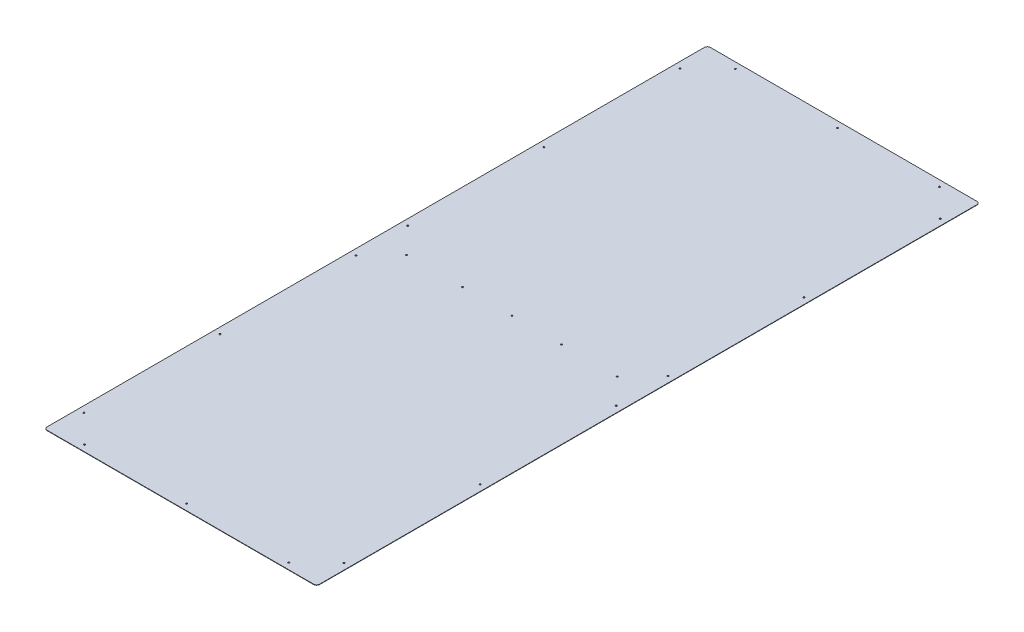
ISO-10303-21;
HEADER;
FILE_DESCRIPTION(('STEP AP214'),'2;1');
FILE_NAME('part.step','',(''),(''),'','','');
FILE_SCHEMA(('AUTOMOTIVE_DESIGN { 1 0 10303 214 1 1 1 1 }'));
ENDSEC;
DATA;
#1=APPLICATION_CONTEXT('core data for automotive mechanical design processes');
#2=APPLICATION_PROTOCOL_DEFINITION('international standard','automotive_design',2000,#1);
#3=PRODUCT_CONTEXT('',#1,'mechanical');
#4=PRODUCT('Part','Part','',(#3));
#5=PRODUCT_RELATED_PRODUCT_CATEGORY('part','',(#4));
#6=PRODUCT_DEFINITION_FORMATION('','',#4);
#7=PRODUCT_DEFINITION_CONTEXT('part definition',#1,'design');
#8=PRODUCT_DEFINITION('design','',#6,#7);
#9=PRODUCT_DEFINITION_SHAPE('','',#8);
#10=(LENGTH_UNIT() NAMED_UNIT(*) SI_UNIT(.MILLI.,.METRE.));
#11=(NAMED_UNIT(*) PLANE_ANGLE_UNIT() SI_UNIT($,.RADIAN.));
#12=(NAMED_UNIT(*) SI_UNIT($,.STERADIAN.) SOLID_ANGLE_UNIT());
#13=UNCERTAINTY_MEASURE_WITH_UNIT(LENGTH_MEASURE(1.E-05),#10,'distance_accuracy_value','');
#14=(GEOMETRIC_REPRESENTATION_CONTEXT(3) GLOBAL_UNCERTAINTY_ASSIGNED_CONTEXT((#13)) GLOBAL_UNIT_ASSIGNED_CONTEXT((#10,
#11,#12)) REPRESENTATION_CONTEXT('',''));
#15=CARTESIAN_POINT('',(0.,0.,0.));
#16=DIRECTION('',(0.,0.,1.));
#17=DIRECTION('',(1.,0.,0.));
#18=AXIS2_PLACEMENT_3D('',#15,#16,#17);
#19=CARTESIAN_POINT('',(279.5524,0.79375,680.3644));
#20=DIRECTION('',(-1.,0.,0.));
#21=DIRECTION('',(0.,0.,1.));
#22=AXIS2_PLACEMENT_3D('',#19,#20,#21);
#23=PLANE('',#22);
#24=DIRECTION('',(0.,0.,-1.));
#25=VECTOR('',#24,1.);
#26=CARTESIAN_POINT('',(279.5524,0.,680.3644));
#27=LINE('',#26,#25);
#28=CARTESIAN_POINT('',(279.5524,0.,674.0144));
#29=VERTEX_POINT('',#28);
#30=CARTESIAN_POINT('',(279.5524,0.,-674.0144));
#31=VERTEX_POINT('',#30);
#32=EDGE_CURVE('E131',#29,#31,#27,.T.);
#33=ORIENTED_EDGE('',*,*,#32,.T.);
#34=DIRECTION('',(0.,-1.,0.));
#35=VECTOR('',#34,1.);
#36=CARTESIAN_POINT('',(279.5524,0.79375,-674.0144));
#37=LINE('',#36,#35);
#38=CARTESIAN_POINT('',(279.5524,0.79375,-674.0144));
#39=VERTEX_POINT('',#38);
#40=EDGE_CURVE('E153',#31,#39,#37,.F.);
#41=ORIENTED_EDGE('',*,*,#40,.T.);
#42=DIRECTION('',(0.,0.,-1.));
#43=VECTOR('',#42,1.);
#44=CARTESIAN_POINT('',(279.5524,0.79375,680.3644));
#45=LINE('',#44,#43);
#46=CARTESIAN_POINT('',(279.5524,0.79375,674.0144));
#47=VERTEX_POINT('',#46);
#48=EDGE_CURVE('E129',#47,#39,#45,.T.);
#49=ORIENTED_EDGE('',*,*,#48,.F.);
#50=DIRECTION('',(0.,-1.,0.));
#51=VECTOR('',#50,1.);
#52=CARTESIAN_POINT('',(279.5524,0.79375,674.0144));
#53=LINE('',#52,#51);
#54=EDGE_CURVE('E150',#47,#29,#53,.T.);
#55=ORIENTED_EDGE('',*,*,#54,.T.);
#56=EDGE_LOOP('',(#33,#41,#49,#55));
#57=FACE_BOUND('',#56,.T.);
#58=ADVANCED_FACE('F34',(#57),#23,.F.);
#59=CARTESIAN_POINT('',(-279.5524,0.79375,-680.3644));
#60=DIRECTION('',(0.,0.,1.));
#61=DIRECTION('',(1.,0.,0.));
#62=AXIS2_PLACEMENT_3D('',#59,#60,#61);
#63=PLANE('',#62);
#64=DIRECTION('',(-1.,0.,0.));
#65=VECTOR('',#64,1.);
#66=CARTESIAN_POINT('',(-279.5524,0.,-680.3644));
#67=LINE('',#66,#65);
#68=CARTESIAN_POINT('',(273.2024,0.,-680.3644));
#69=VERTEX_POINT('',#68);
#70=CARTESIAN_POINT('',(-273.2024,0.,-680.3644));
#71=VERTEX_POINT('',#70);
#72=EDGE_CURVE('E127',#69,#71,#67,.T.);
#73=ORIENTED_EDGE('',*,*,#72,.T.);
#74=DIRECTION('',(0.,-1.,0.));
#75=VECTOR('',#74,1.);
#76=CARTESIAN_POINT('',(-273.2024,0.79375,-680.3644));
#77=LINE('',#76,#75);
#78=CARTESIAN_POINT('',(-273.2024,0.79375,-680.3644));
#79=VERTEX_POINT('',#78);
#80=EDGE_CURVE('E105',#71,#79,#77,.F.);
#81=ORIENTED_EDGE('',*,*,#80,.T.);
#82=DIRECTION('',(-1.,0.,0.));
#83=VECTOR('',#82,1.);
#84=CARTESIAN_POINT('',(-279.5524,0.79375,-680.3644));
#85=LINE('',#84,#83);
#86=CARTESIAN_POINT('',(273.2024,0.79375,-680.3644));
#87=VERTEX_POINT('',#86);
#88=EDGE_CURVE('E167',#87,#79,#85,.T.);
#89=ORIENTED_EDGE('',*,*,#88,.F.);
#90=DIRECTION('',(0.,-1.,0.));
#91=VECTOR('',#90,1.);
#92=CARTESIAN_POINT('',(273.2024,0.79375,-680.3644));
#93=LINE('',#92,#91);
#94=EDGE_CURVE('E110',#87,#69,#93,.T.);
#95=ORIENTED_EDGE('',*,*,#94,.T.);
#96=EDGE_LOOP('',(#73,#81,#89,#95));
#97=FACE_BOUND('',#96,.T.);
#98=ADVANCED_FACE('F172',(#97),#63,.F.);
#99=CARTESIAN_POINT('',(-279.5524,0.79375,680.3644));
#100=DIRECTION('',(1.,0.,0.));
#101=DIRECTION('',(0.,0.,-1.));
#102=AXIS2_PLACEMENT_3D('',#99,#100,#101);
#103=PLANE('',#102);
#104=DIRECTION('',(0.,0.,1.));
#105=VECTOR('',#104,1.);
#106=CARTESIAN_POINT('',(-279.5524,0.79375,680.3644));
#107=LINE('',#106,#105);
#108=CARTESIAN_POINT('',(-279.5524,0.79375,-674.0144));
#109=VERTEX_POINT('',#108);
#110=CARTESIAN_POINT('',(-279.5524,0.79375,674.0144));
#111=VERTEX_POINT('',#110);
#112=EDGE_CURVE('E119',#109,#111,#107,.T.);
#113=ORIENTED_EDGE('',*,*,#112,.F.);
#114=DIRECTION('',(0.,-1.,0.));
#115=VECTOR('',#114,1.);
#116=CARTESIAN_POINT('',(-279.5524,0.79375,-674.0144));
#117=LINE('',#116,#115);
#118=CARTESIAN_POINT('',(-279.5524,0.,-674.0144));
#119=VERTEX_POINT('',#118);
#120=EDGE_CURVE('E104',#109,#119,#117,.T.);
#121=ORIENTED_EDGE('',*,*,#120,.T.);
#122=DIRECTION('',(0.,0.,1.));
#123=VECTOR('',#122,1.);
#124=CARTESIAN_POINT('',(-279.5524,0.,680.3644));
#125=LINE('',#124,#123);
#126=CARTESIAN_POINT('',(-279.5524,0.,674.0144));
#127=VERTEX_POINT('',#126);
#128=EDGE_CURVE('E117',#119,#127,#125,.T.);
#129=ORIENTED_EDGE('',*,*,#128,.T.);
#130=DIRECTION('',(0.,-1.,0.));
#131=VECTOR('',#130,1.);
#132=CARTESIAN_POINT('',(-279.5524,0.79375,674.0144));
#133=LINE('',#132,#131);
#134=EDGE_CURVE('E121',#127,#111,#133,.F.);
#135=ORIENTED_EDGE('',*,*,#134,.T.);
#136=EDGE_LOOP('',(#113,#121,#129,#135));
#137=FACE_BOUND('',#136,.T.);
#138=ADVANCED_FACE('F116',(#137),#103,.F.);
#139=CARTESIAN_POINT('',(-279.5524,0.79375,680.3644));
#140=DIRECTION('',(0.,0.,-1.));
#141=DIRECTION('',(-1.,0.,0.));
#142=AXIS2_PLACEMENT_3D('',#139,#140,#141);
#143=PLANE('',#142);
#144=DIRECTION('',(1.,0.,0.));
#145=VECTOR('',#144,1.);
#146=CARTESIAN_POINT('',(-279.5524,0.79375,680.3644));
#147=LINE('',#146,#145);
#148=CARTESIAN_POINT('',(-273.2024,0.79375,680.3644));
#149=VERTEX_POINT('',#148);
#150=CARTESIAN_POINT('',(273.2024,0.79375,680.3644));
#151=VERTEX_POINT('',#150);
#152=EDGE_CURVE('E135',#149,#151,#147,.T.);
#153=ORIENTED_EDGE('',*,*,#152,.F.);
#154=DIRECTION('',(0.,-1.,0.));
#155=VECTOR('',#154,1.);
#156=CARTESIAN_POINT('',(-273.2024,0.79375,680.3644));
#157=LINE('',#156,#155);
#158=CARTESIAN_POINT('',(-273.2024,0.,680.3644));
#159=VERTEX_POINT('',#158);
#160=EDGE_CURVE('E11',#149,#159,#157,.T.);
#161=ORIENTED_EDGE('',*,*,#160,.T.);
#162=DIRECTION('',(1.,0.,0.));
#163=VECTOR('',#162,1.);
#164=CARTESIAN_POINT('',(-279.5524,0.,680.3644));
#165=LINE('',#164,#163);
#166=CARTESIAN_POINT('',(273.2024,0.,680.3644));
#167=VERTEX_POINT('',#166);
#168=EDGE_CURVE('E126',#159,#167,#165,.T.);
#169=ORIENTED_EDGE('',*,*,#168,.T.);
#170=DIRECTION('',(0.,-1.,0.));
#171=VECTOR('',#170,1.);
#172=CARTESIAN_POINT('',(273.2024,0.79375,680.3644));
#173=LINE('',#172,#171);
#174=EDGE_CURVE('E42',#167,#151,#173,.F.);
#175=ORIENTED_EDGE('',*,*,#174,.T.);
#176=EDGE_LOOP('',(#153,#161,#169,#175));
#177=FACE_BOUND('',#176,.T.);
#178=ADVANCED_FACE('F397',(#177),#143,.F.);
#179=CARTESIAN_POINT('',(0.,0.79375,0.));
#180=DIRECTION('',(0.,-1.,0.));
#181=DIRECTION('',(0.,0.,-1.));
#182=AXIS2_PLACEMENT_3D('',#179,#180,#181);
#183=PLANE('',#182);
#184=CARTESIAN_POINT('',(266.8524,0.79375,611.632));
#185=DIRECTION('',(0.,-1.,0.));
#186=DIRECTION('',(0.,0.,-1.));
#187=AXIS2_PLACEMENT_3D('',#184,#185,#186);
#188=CIRCLE('',#187,1.58750000000002);
#189=CARTESIAN_POINT('',(266.8524,0.79375,610.0445));
#190=VERTEX_POINT('',#189);
#191=EDGE_CURVE('E309',#190,#190,#188,.T.);
#192=ORIENTED_EDGE('',*,*,#191,.T.);
#193=EDGE_LOOP('',(#192));
#194=FACE_BOUND('',#193,.T.);
#195=CARTESIAN_POINT('',(209.55,0.79375,667.6644));
#196=DIRECTION('',(0.,-1.,0.));
#197=DIRECTION('',(0.,0.,-1.));
#198=AXIS2_PLACEMENT_3D('',#195,#196,#197);
#199=CIRCLE('',#198,1.58749999999999);
#200=CARTESIAN_POINT('',(209.55,0.79375,666.0769));
#201=VERTEX_POINT('',#200);
#202=EDGE_CURVE('E303',#201,#201,#199,.T.);
#203=ORIENTED_EDGE('',*,*,#202,.T.);
#204=EDGE_LOOP('',(#203));
#205=FACE_BOUND('',#204,.T.);
#206=CARTESIAN_POINT('',(266.852400000001,0.79375,332.232));
#207=DIRECTION('',(0.,-1.,0.));
#208=DIRECTION('',(0.,0.,-1.));
#209=AXIS2_PLACEMENT_3D('',#206,#207,#208);
#210=CIRCLE('',#209,1.58750000000002);
#211=CARTESIAN_POINT('',(266.852400000001,0.79375,330.6445));
#212=VERTEX_POINT('',#211);
#213=EDGE_CURVE('E297',#212,#212,#210,.T.);
#214=ORIENTED_EDGE('',*,*,#213,.T.);
#215=EDGE_LOOP('',(#214));
#216=FACE_BOUND('',#215,.T.);
#217=CARTESIAN_POINT('',(3.2271277664031E-13,0.79375,667.6644));
#218=DIRECTION('',(0.,-1.,0.));
#219=DIRECTION('',(0.,0.,-1.));
#220=AXIS2_PLACEMENT_3D('',#217,#218,#219);
#221=CIRCLE('',#220,1.5875);
#222=CARTESIAN_POINT('',(3.2271277664031E-13,0.79375,666.0769));
#223=VERTEX_POINT('',#222);
#224=EDGE_CURVE('E291',#223,#223,#221,.T.);
#225=ORIENTED_EDGE('',*,*,#224,.T.);
#226=EDGE_LOOP('',(#225));
#227=FACE_BOUND('',#226,.T.);
#228=CARTESIAN_POINT('',(-209.55,0.79375,667.6644));
#229=DIRECTION('',(0.,-1.,0.));
#230=DIRECTION('',(0.,0.,-1.));
#231=AXIS2_PLACEMENT_3D('',#228,#229,#230);
#232=CIRCLE('',#231,1.58749999999999);
#233=CARTESIAN_POINT('',(-209.55,0.79375,666.0769));
#234=VERTEX_POINT('',#233);
#235=EDGE_CURVE('E285',#234,#234,#232,.T.);
#236=ORIENTED_EDGE('',*,*,#235,.T.);
#237=EDGE_LOOP('',(#236));
#238=FACE_BOUND('',#237,.T.);
#239=CARTESIAN_POINT('',(-266.8524,0.79375,611.632));
#240=DIRECTION('',(0.,-1.,0.));
#241=DIRECTION('',(0.,0.,-1.));
#242=AXIS2_PLACEMENT_3D('',#239,#240,#241);
#243=CIRCLE('',#242,1.58750000000002);
#244=CARTESIAN_POINT('',(-266.8524,0.79375,610.0445));
#245=VERTEX_POINT('',#244);
#246=EDGE_CURVE('E279',#245,#245,#243,.T.);
#247=ORIENTED_EDGE('',*,*,#246,.T.);
#248=EDGE_LOOP('',(#247));
#249=FACE_BOUND('',#248,.T.);
#250=CARTESIAN_POINT('',(-266.8524,0.79375,332.232));
#251=DIRECTION('',(0.,-1.,0.));
#252=DIRECTION('',(0.,0.,-1.));
#253=AXIS2_PLACEMENT_3D('',#250,#251,#252);
#254=CIRCLE('',#253,1.58750000000002);
#255=CARTESIAN_POINT('',(-266.8524,0.79375,330.6445));
#256=VERTEX_POINT('',#255);
#257=EDGE_CURVE('E273',#256,#256,#254,.T.);
#258=ORIENTED_EDGE('',*,*,#257,.T.);
#259=EDGE_LOOP('',(#258));
#260=FACE_BOUND('',#259,.T.);
#261=CARTESIAN_POINT('',(-266.8524,0.79375,52.8320000000002));
#262=DIRECTION('',(0.,-1.,0.));
#263=DIRECTION('',(0.,0.,-1.));
#264=AXIS2_PLACEMENT_3D('',#261,#262,#263);
#265=CIRCLE('',#264,1.58750000000002);
#266=CARTESIAN_POINT('',(-266.8524,0.79375,51.2445000000002));
#267=VERTEX_POINT('',#266);
#268=EDGE_CURVE('E267',#267,#267,#265,.T.);
#269=ORIENTED_EDGE('',*,*,#268,.T.);
#270=EDGE_LOOP('',(#269));
#271=FACE_BOUND('',#270,.T.);
#272=CARTESIAN_POINT('',(-266.852399999999,0.79375,-52.9081999999999));
#273=DIRECTION('',(0.,-1.,0.));
#274=DIRECTION('',(0.,0.,-1.));
#275=AXIS2_PLACEMENT_3D('',#272,#273,#274);
#276=CIRCLE('',#275,1.58750000000002);
#277=CARTESIAN_POINT('',(-266.852399999999,0.79375,-54.4956999999999));
#278=VERTEX_POINT('',#277);
#279=EDGE_CURVE('E261',#278,#278,#276,.T.);
#280=ORIENTED_EDGE('',*,*,#279,.T.);
#281=EDGE_LOOP('',(#280));
#282=FACE_BOUND('',#281,.T.);
#283=CARTESIAN_POINT('',(266.852400000001,0.79375,52.8320000000002));
#284=DIRECTION('',(0.,-1.,0.));
#285=DIRECTION('',(0.,0.,-1.));
#286=AXIS2_PLACEMENT_3D('',#283,#284,#285);
#287=CIRCLE('',#286,1.58750000000002);
#288=CARTESIAN_POINT('',(266.852400000001,0.79375,51.2445000000002));
#289=VERTEX_POINT('',#288);
#290=EDGE_CURVE('E255',#289,#289,#287,.T.);
#291=ORIENTED_EDGE('',*,*,#290,.T.);
#292=EDGE_LOOP('',(#291));
#293=FACE_BOUND('',#292,.T.);
#294=CARTESIAN_POINT('',(266.852400000001,0.79375,-52.9082));
#295=DIRECTION('',(0.,-1.,0.));
#296=DIRECTION('',(0.,0.,-1.));
#297=AXIS2_PLACEMENT_3D('',#294,#295,#296);
#298=CIRCLE('',#297,1.58750000000002);
#299=CARTESIAN_POINT('',(266.852400000001,0.79375,-54.4957));
#300=VERTEX_POINT('',#299);
#301=EDGE_CURVE('E249',#300,#300,#298,.T.);
#302=ORIENTED_EDGE('',*,*,#301,.T.);
#303=EDGE_LOOP('',(#302));
#304=FACE_BOUND('',#303,.T.);
#305=CARTESIAN_POINT('',(266.852400000001,0.79375,-332.3082));
#306=DIRECTION('',(0.,-1.,0.));
#307=DIRECTION('',(0.,0.,-1.));
#308=AXIS2_PLACEMENT_3D('',#305,#306,#307);
#309=CIRCLE('',#308,1.58750000000002);
#310=CARTESIAN_POINT('',(266.852400000001,0.79375,-333.8957));
#311=VERTEX_POINT('',#310);
#312=EDGE_CURVE('E243',#311,#311,#309,.T.);
#313=ORIENTED_EDGE('',*,*,#312,.T.);
#314=EDGE_LOOP('',(#313));
#315=FACE_BOUND('',#314,.T.);
#316=CARTESIAN_POINT('',(266.852400000001,0.79375,-611.7082));
#317=DIRECTION('',(0.,-1.,0.));
#318=DIRECTION('',(0.,0.,-1.));
#319=AXIS2_PLACEMENT_3D('',#316,#317,#318);
#320=CIRCLE('',#319,1.58750000000002);
#321=CARTESIAN_POINT('',(266.852400000001,0.79375,-613.2957));
#322=VERTEX_POINT('',#321);
#323=EDGE_CURVE('E237',#322,#322,#320,.T.);
#324=ORIENTED_EDGE('',*,*,#323,.T.);
#325=EDGE_LOOP('',(#324));
#326=FACE_BOUND('',#325,.T.);
#327=CARTESIAN_POINT('',(209.55,0.79375,-667.7406));
#328=DIRECTION('',(0.,-1.,0.));
#329=DIRECTION('',(0.,0.,-1.));
#330=AXIS2_PLACEMENT_3D('',#327,#328,#329);
#331=CIRCLE('',#330,1.58749999999999);
#332=CARTESIAN_POINT('',(209.55,0.79375,-669.3281));
#333=VERTEX_POINT('',#332);
#334=EDGE_CURVE('E231',#333,#333,#331,.T.);
#335=ORIENTED_EDGE('',*,*,#334,.T.);
#336=EDGE_LOOP('',(#335));
#337=FACE_BOUND('',#336,.T.);
#338=CARTESIAN_POINT('',(4.81021993993152E-13,0.79375,-667.7406));
#339=DIRECTION('',(0.,-1.,0.));
#340=DIRECTION('',(0.,0.,-1.));
#341=AXIS2_PLACEMENT_3D('',#338,#339,#340);
#342=CIRCLE('',#341,1.5875);
#343=CARTESIAN_POINT('',(4.81021993993152E-13,0.79375,-669.3281));
#344=VERTEX_POINT('',#343);
#345=EDGE_CURVE('E225',#344,#344,#342,.T.);
#346=ORIENTED_EDGE('',*,*,#345,.T.);
#347=EDGE_LOOP('',(#346));
#348=FACE_BOUND('',#347,.T.);
#349=CARTESIAN_POINT('',(-266.852399999999,0.79375,-332.3082));
#350=DIRECTION('',(0.,-1.,0.));
#351=DIRECTION('',(0.,0.,-1.));
#352=AXIS2_PLACEMENT_3D('',#349,#350,#351);
#353=CIRCLE('',#352,1.58750000000002);
#354=CARTESIAN_POINT('',(-266.852399999999,0.79375,-333.8957));
#355=VERTEX_POINT('',#354);
#356=EDGE_CURVE('E219',#355,#355,#353,.T.);
#357=ORIENTED_EDGE('',*,*,#356,.T.);
#358=EDGE_LOOP('',(#357));
#359=FACE_BOUND('',#358,.T.);
#360=CARTESIAN_POINT('',(-266.852399999999,0.79375,-611.632));
#361=DIRECTION('',(0.,-1.,0.));
#362=DIRECTION('',(0.,0.,-1.));
#363=AXIS2_PLACEMENT_3D('',#360,#361,#362);
#364=CIRCLE('',#363,1.58750000000002);
#365=CARTESIAN_POINT('',(-266.852399999999,0.79375,-613.2195));
#366=VERTEX_POINT('',#365);
#367=EDGE_CURVE('E213',#366,#366,#364,.T.);
#368=ORIENTED_EDGE('',*,*,#367,.T.);
#369=EDGE_LOOP('',(#368));
#370=FACE_BOUND('',#369,.T.);
#371=CARTESIAN_POINT('',(-209.55,0.79375,-667.7406));
#372=DIRECTION('',(0.,-1.,0.));
#373=DIRECTION('',(0.,0.,-1.));
#374=AXIS2_PLACEMENT_3D('',#371,#372,#373);
#375=CIRCLE('',#374,1.58749999999999);
#376=CARTESIAN_POINT('',(-209.55,0.79375,-669.3281));
#377=VERTEX_POINT('',#376);
#378=EDGE_CURVE('E207',#377,#377,#375,.T.);
#379=ORIENTED_EDGE('',*,*,#378,.T.);
#380=EDGE_LOOP('',(#379));
#381=FACE_BOUND('',#380,.T.);
#382=CARTESIAN_POINT('',(216.0524,0.79375,1.11022302462516E-13));
#383=DIRECTION('',(0.,-1.,0.));
#384=DIRECTION('',(0.,0.,-1.));
#385=AXIS2_PLACEMENT_3D('',#382,#383,#384);
#386=CIRCLE('',#385,1.58749999999999);
#387=CARTESIAN_POINT('',(216.0524,0.79375,-1.58749999999988));
#388=VERTEX_POINT('',#387);
#389=EDGE_CURVE('E201',#388,#388,#386,.T.);
#390=ORIENTED_EDGE('',*,*,#389,.T.);
#391=EDGE_LOOP('',(#390));
#392=FACE_BOUND('',#391,.T.);
#393=CARTESIAN_POINT('',(101.752400000001,0.79375,1.11022302462516E-13));
#394=DIRECTION('',(0.,-1.,0.));
#395=DIRECTION('',(0.,0.,-1.));
#396=AXIS2_PLACEMENT_3D('',#393,#394,#395);
#397=CIRCLE('',#396,1.58750000000001);
#398=CARTESIAN_POINT('',(101.752400000001,0.79375,-1.58749999999989));
#399=VERTEX_POINT('',#398);
#400=EDGE_CURVE('E195',#399,#399,#397,.T.);
#401=ORIENTED_EDGE('',*,*,#400,.T.);
#402=EDGE_LOOP('',(#401));
#403=FACE_BOUND('',#402,.T.);
#404=CARTESIAN_POINT('',(0.,0.79375,0.));
#405=DIRECTION('',(0.,-1.,0.));
#406=DIRECTION('',(0.,0.,-1.));
#407=AXIS2_PLACEMENT_3D('',#404,#405,#406);
#408=CIRCLE('',#407,1.5875);
#409=CARTESIAN_POINT('',(0.,0.79375,-1.5875));
#410=VERTEX_POINT('',#409);
#411=EDGE_CURVE('E189',#410,#410,#408,.T.);
#412=ORIENTED_EDGE('',*,*,#411,.T.);
#413=EDGE_LOOP('',(#412));
#414=FACE_BOUND('',#413,.T.);
#415=CARTESIAN_POINT('',(-101.752399999999,0.79375,2.70101866220451E-13));
#416=DIRECTION('',(0.,-1.,0.));
#417=DIRECTION('',(0.,0.,-1.));
#418=AXIS2_PLACEMENT_3D('',#415,#416,#417);
#419=CIRCLE('',#418,1.58750000000001);
#420=CARTESIAN_POINT('',(-101.752399999999,0.79375,-1.58749999999974));
#421=VERTEX_POINT('',#420);
#422=EDGE_CURVE('E183',#421,#421,#419,.T.);
#423=ORIENTED_EDGE('',*,*,#422,.T.);
#424=EDGE_LOOP('',(#423));
#425=FACE_BOUND('',#424,.T.);
#426=CARTESIAN_POINT('',(-216.052399999999,0.79375,0.));
#427=DIRECTION('',(0.,-1.,0.));
#428=DIRECTION('',(0.,0.,-1.));
#429=AXIS2_PLACEMENT_3D('',#426,#427,#428);
#430=CIRCLE('',#429,1.58749999999999);
#431=CARTESIAN_POINT('',(-216.052399999999,0.79375,-1.58749999999996));
#432=VERTEX_POINT('',#431);
#433=EDGE_CURVE('E173',#432,#432,#430,.T.);
#434=ORIENTED_EDGE('',*,*,#433,.T.);
#435=EDGE_LOOP('',(#434));
#436=FACE_BOUND('',#435,.T.);
#437=ORIENTED_EDGE('',*,*,#88,.T.);
#438=CARTESIAN_POINT('',(-273.2024,0.79375,-674.0144));
#439=DIRECTION('',(0.,-1.,0.));
#440=DIRECTION('',(0.,0.,-1.));
#441=AXIS2_PLACEMENT_3D('',#438,#439,#440);
#442=CIRCLE('',#441,6.35);
#443=EDGE_CURVE('E148',#79,#109,#442,.F.);
#444=ORIENTED_EDGE('',*,*,#443,.T.);
#445=ORIENTED_EDGE('',*,*,#112,.T.);
#446=CARTESIAN_POINT('',(-273.2024,0.79375,674.0144));
#447=DIRECTION('',(0.,-1.,0.));
#448=DIRECTION('',(0.,0.,-1.));
#449=AXIS2_PLACEMENT_3D('',#446,#447,#448);
#450=CIRCLE('',#449,6.35);
#451=EDGE_CURVE('E55',#111,#149,#450,.F.);
#452=ORIENTED_EDGE('',*,*,#451,.T.);
#453=ORIENTED_EDGE('',*,*,#152,.T.);
#454=CARTESIAN_POINT('',(273.2024,0.79375,674.0144));
#455=DIRECTION('',(0.,-1.,0.));
#456=DIRECTION('',(0.,0.,-1.));
#457=AXIS2_PLACEMENT_3D('',#454,#455,#456);
#458=CIRCLE('',#457,6.35);
#459=EDGE_CURVE('E143',#151,#47,#458,.F.);
#460=ORIENTED_EDGE('',*,*,#459,.T.);
#461=ORIENTED_EDGE('',*,*,#48,.T.);
#462=CARTESIAN_POINT('',(273.2024,0.79375,-674.0144));
#463=DIRECTION('',(0.,-1.,0.));
#464=DIRECTION('',(0.,0.,-1.));
#465=AXIS2_PLACEMENT_3D('',#462,#463,#464);
#466=CIRCLE('',#465,6.35);
#467=EDGE_CURVE('E146',#39,#87,#466,.F.);
#468=ORIENTED_EDGE('',*,*,#467,.T.);
#469=EDGE_LOOP('',(#437,#444,#445,#452,#453,#460,#461,#468));
#470=FACE_BOUND('',#469,.T.);
#471=ADVANCED_FACE('F164',(#194,#205,#216,#227,#238,#249,#260,#271,#282,#293,#304,#315,#326,
#337,#348,#359,#370,#381,#392,#403,#414,#425,#436,#470),#183,.F.);
#472=CARTESIAN_POINT('',(0.,0.,0.));
#473=DIRECTION('',(0.,-1.,0.));
#474=DIRECTION('',(0.,0.,-1.));
#475=AXIS2_PLACEMENT_3D('',#472,#473,#474);
#476=PLANE('',#475);
#477=CARTESIAN_POINT('',(266.8524,0.,611.632));
#478=DIRECTION('',(0.,-1.,0.));
#479=DIRECTION('',(0.,0.,-1.));
#480=AXIS2_PLACEMENT_3D('',#477,#478,#479);
#481=CIRCLE('',#480,1.58750000000002);
#482=CARTESIAN_POINT('',(266.8524,0.,610.0445));
#483=VERTEX_POINT('',#482);
#484=EDGE_CURVE('E312',#483,#483,#481,.T.);
#485=ORIENTED_EDGE('',*,*,#484,.F.);
#486=EDGE_LOOP('',(#485));
#487=FACE_BOUND('',#486,.T.);
#488=CARTESIAN_POINT('',(209.55,0.,667.6644));
#489=DIRECTION('',(0.,-1.,0.));
#490=DIRECTION('',(0.,0.,-1.));
#491=AXIS2_PLACEMENT_3D('',#488,#489,#490);
#492=CIRCLE('',#491,1.58749999999999);
#493=CARTESIAN_POINT('',(209.55,0.,666.0769));
#494=VERTEX_POINT('',#493);
#495=EDGE_CURVE('E306',#494,#494,#492,.T.);
#496=ORIENTED_EDGE('',*,*,#495,.F.);
#497=EDGE_LOOP('',(#496));
#498=FACE_BOUND('',#497,.T.);
#499=CARTESIAN_POINT('',(266.852400000001,0.,332.232));
#500=DIRECTION('',(0.,-1.,0.));
#501=DIRECTION('',(0.,0.,-1.));
#502=AXIS2_PLACEMENT_3D('',#499,#500,#501);
#503=CIRCLE('',#502,1.58750000000002);
#504=CARTESIAN_POINT('',(266.852400000001,0.,330.6445));
#505=VERTEX_POINT('',#504);
#506=EDGE_CURVE('E300',#505,#505,#503,.T.);
#507=ORIENTED_EDGE('',*,*,#506,.F.);
#508=EDGE_LOOP('',(#507));
#509=FACE_BOUND('',#508,.T.);
#510=CARTESIAN_POINT('',(3.2271277664031E-13,0.,667.6644));
#511=DIRECTION('',(0.,-1.,0.));
#512=DIRECTION('',(0.,0.,-1.));
#513=AXIS2_PLACEMENT_3D('',#510,#511,#512);
#514=CIRCLE('',#513,1.5875);
#515=CARTESIAN_POINT('',(3.2271277664031E-13,0.,666.0769));
#516=VERTEX_POINT('',#515);
#517=EDGE_CURVE('E294',#516,#516,#514,.T.);
#518=ORIENTED_EDGE('',*,*,#517,.F.);
#519=EDGE_LOOP('',(#518));
#520=FACE_BOUND('',#519,.T.);
#521=CARTESIAN_POINT('',(-209.55,0.,667.6644));
#522=DIRECTION('',(0.,-1.,0.));
#523=DIRECTION('',(0.,0.,-1.));
#524=AXIS2_PLACEMENT_3D('',#521,#522,#523);
#525=CIRCLE('',#524,1.58749999999999);
#526=CARTESIAN_POINT('',(-209.55,0.,666.0769));
#527=VERTEX_POINT('',#526);
#528=EDGE_CURVE('E288',#527,#527,#525,.T.);
#529=ORIENTED_EDGE('',*,*,#528,.F.);
#530=EDGE_LOOP('',(#529));
#531=FACE_BOUND('',#530,.T.);
#532=CARTESIAN_POINT('',(-266.8524,0.,611.632));
#533=DIRECTION('',(0.,-1.,0.));
#534=DIRECTION('',(0.,0.,-1.));
#535=AXIS2_PLACEMENT_3D('',#532,#533,#534);
#536=CIRCLE('',#535,1.58750000000002);
#537=CARTESIAN_POINT('',(-266.8524,0.,610.0445));
#538=VERTEX_POINT('',#537);
#539=EDGE_CURVE('E282',#538,#538,#536,.T.);
#540=ORIENTED_EDGE('',*,*,#539,.F.);
#541=EDGE_LOOP('',(#540));
#542=FACE_BOUND('',#541,.T.);
#543=CARTESIAN_POINT('',(-266.8524,0.,332.232));
#544=DIRECTION('',(0.,-1.,0.));
#545=DIRECTION('',(0.,0.,-1.));
#546=AXIS2_PLACEMENT_3D('',#543,#544,#545);
#547=CIRCLE('',#546,1.58750000000002);
#548=CARTESIAN_POINT('',(-266.8524,0.,330.6445));
#549=VERTEX_POINT('',#548);
#550=EDGE_CURVE('E276',#549,#549,#547,.T.);
#551=ORIENTED_EDGE('',*,*,#550,.F.);
#552=EDGE_LOOP('',(#551));
#553=FACE_BOUND('',#552,.T.);
#554=CARTESIAN_POINT('',(-266.8524,0.,52.8320000000002));
#555=DIRECTION('',(0.,-1.,0.));
#556=DIRECTION('',(0.,0.,-1.));
#557=AXIS2_PLACEMENT_3D('',#554,#555,#556);
#558=CIRCLE('',#557,1.58750000000002);
#559=CARTESIAN_POINT('',(-266.8524,0.,51.2445000000002));
#560=VERTEX_POINT('',#559);
#561=EDGE_CURVE('E270',#560,#560,#558,.T.);
#562=ORIENTED_EDGE('',*,*,#561,.F.);
#563=EDGE_LOOP('',(#562));
#564=FACE_BOUND('',#563,.T.);
#565=CARTESIAN_POINT('',(-266.852399999999,0.,-52.9081999999999));
#566=DIRECTION('',(0.,-1.,0.));
#567=DIRECTION('',(0.,0.,-1.));
#568=AXIS2_PLACEMENT_3D('',#565,#566,#567);
#569=CIRCLE('',#568,1.58750000000002);
#570=CARTESIAN_POINT('',(-266.852399999999,0.,-54.4956999999999));
#571=VERTEX_POINT('',#570);
#572=EDGE_CURVE('E264',#571,#571,#569,.T.);
#573=ORIENTED_EDGE('',*,*,#572,.F.);
#574=EDGE_LOOP('',(#573));
#575=FACE_BOUND('',#574,.T.);
#576=CARTESIAN_POINT('',(266.852400000001,0.,52.8320000000002));
#577=DIRECTION('',(0.,-1.,0.));
#578=DIRECTION('',(0.,0.,-1.));
#579=AXIS2_PLACEMENT_3D('',#576,#577,#578);
#580=CIRCLE('',#579,1.58750000000002);
#581=CARTESIAN_POINT('',(266.852400000001,0.,51.2445000000002));
#582=VERTEX_POINT('',#581);
#583=EDGE_CURVE('E258',#582,#582,#580,.T.);
#584=ORIENTED_EDGE('',*,*,#583,.F.);
#585=EDGE_LOOP('',(#584));
#586=FACE_BOUND('',#585,.T.);
#587=CARTESIAN_POINT('',(266.852400000001,0.,-52.9082));
#588=DIRECTION('',(0.,-1.,0.));
#589=DIRECTION('',(0.,0.,-1.));
#590=AXIS2_PLACEMENT_3D('',#587,#588,#589);
#591=CIRCLE('',#590,1.58750000000002);
#592=CARTESIAN_POINT('',(266.852400000001,0.,-54.4957));
#593=VERTEX_POINT('',#592);
#594=EDGE_CURVE('E252',#593,#593,#591,.T.);
#595=ORIENTED_EDGE('',*,*,#594,.F.);
#596=EDGE_LOOP('',(#595));
#597=FACE_BOUND('',#596,.T.);
#598=CARTESIAN_POINT('',(266.852400000001,0.,-332.3082));
#599=DIRECTION('',(0.,-1.,0.));
#600=DIRECTION('',(0.,0.,-1.));
#601=AXIS2_PLACEMENT_3D('',#598,#599,#600);
#602=CIRCLE('',#601,1.58750000000002);
#603=CARTESIAN_POINT('',(266.852400000001,0.,-333.8957));
#604=VERTEX_POINT('',#603);
#605=EDGE_CURVE('E246',#604,#604,#602,.T.);
#606=ORIENTED_EDGE('',*,*,#605,.F.);
#607=EDGE_LOOP('',(#606));
#608=FACE_BOUND('',#607,.T.);
#609=CARTESIAN_POINT('',(266.852400000001,0.,-611.7082));
#610=DIRECTION('',(0.,-1.,0.));
#611=DIRECTION('',(0.,0.,-1.));
#612=AXIS2_PLACEMENT_3D('',#609,#610,#611);
#613=CIRCLE('',#612,1.58750000000002);
#614=CARTESIAN_POINT('',(266.852400000001,0.,-613.2957));
#615=VERTEX_POINT('',#614);
#616=EDGE_CURVE('E240',#615,#615,#613,.T.);
#617=ORIENTED_EDGE('',*,*,#616,.F.);
#618=EDGE_LOOP('',(#617));
#619=FACE_BOUND('',#618,.T.);
#620=CARTESIAN_POINT('',(209.55,0.,-667.7406));
#621=DIRECTION('',(0.,-1.,0.));
#622=DIRECTION('',(0.,0.,-1.));
#623=AXIS2_PLACEMENT_3D('',#620,#621,#622);
#624=CIRCLE('',#623,1.58749999999999);
#625=CARTESIAN_POINT('',(209.55,0.,-669.3281));
#626=VERTEX_POINT('',#625);
#627=EDGE_CURVE('E234',#626,#626,#624,.T.);
#628=ORIENTED_EDGE('',*,*,#627,.F.);
#629=EDGE_LOOP('',(#628));
#630=FACE_BOUND('',#629,.T.);
#631=CARTESIAN_POINT('',(4.81021993993152E-13,0.,-667.7406));
#632=DIRECTION('',(0.,-1.,0.));
#633=DIRECTION('',(0.,0.,-1.));
#634=AXIS2_PLACEMENT_3D('',#631,#632,#633);
#635=CIRCLE('',#634,1.5875);
#636=CARTESIAN_POINT('',(4.81021993993152E-13,0.,-669.3281));
#637=VERTEX_POINT('',#636);
#638=EDGE_CURVE('E228',#637,#637,#635,.T.);
#639=ORIENTED_EDGE('',*,*,#638,.F.);
#640=EDGE_LOOP('',(#639));
#641=FACE_BOUND('',#640,.T.);
#642=CARTESIAN_POINT('',(-266.852399999999,0.,-332.3082));
#643=DIRECTION('',(0.,-1.,0.));
#644=DIRECTION('',(0.,0.,-1.));
#645=AXIS2_PLACEMENT_3D('',#642,#643,#644);
#646=CIRCLE('',#645,1.58750000000002);
#647=CARTESIAN_POINT('',(-266.852399999999,0.,-333.8957));
#648=VERTEX_POINT('',#647);
#649=EDGE_CURVE('E222',#648,#648,#646,.T.);
#650=ORIENTED_EDGE('',*,*,#649,.F.);
#651=EDGE_LOOP('',(#650));
#652=FACE_BOUND('',#651,.T.);
#653=CARTESIAN_POINT('',(-266.852399999999,0.,-611.632));
#654=DIRECTION('',(0.,-1.,0.));
#655=DIRECTION('',(0.,0.,-1.));
#656=AXIS2_PLACEMENT_3D('',#653,#654,#655);
#657=CIRCLE('',#656,1.58750000000002);
#658=CARTESIAN_POINT('',(-266.852399999999,0.,-613.2195));
#659=VERTEX_POINT('',#658);
#660=EDGE_CURVE('E216',#659,#659,#657,.T.);
#661=ORIENTED_EDGE('',*,*,#660,.F.);
#662=EDGE_LOOP('',(#661));
#663=FACE_BOUND('',#662,.T.);
#664=CARTESIAN_POINT('',(-209.55,0.,-667.7406));
#665=DIRECTION('',(0.,-1.,0.));
#666=DIRECTION('',(0.,0.,-1.));
#667=AXIS2_PLACEMENT_3D('',#664,#665,#666);
#668=CIRCLE('',#667,1.58749999999999);
#669=CARTESIAN_POINT('',(-209.55,0.,-669.3281));
#670=VERTEX_POINT('',#669);
#671=EDGE_CURVE('E210',#670,#670,#668,.T.);
#672=ORIENTED_EDGE('',*,*,#671,.F.);
#673=EDGE_LOOP('',(#672));
#674=FACE_BOUND('',#673,.T.);
#675=CARTESIAN_POINT('',(216.0524,0.,1.11022302462516E-13));
#676=DIRECTION('',(0.,-1.,0.));
#677=DIRECTION('',(0.,0.,-1.));
#678=AXIS2_PLACEMENT_3D('',#675,#676,#677);
#679=CIRCLE('',#678,1.58749999999999);
#680=CARTESIAN_POINT('',(216.0524,0.,-1.58749999999988));
#681=VERTEX_POINT('',#680);
#682=EDGE_CURVE('E204',#681,#681,#679,.T.);
#683=ORIENTED_EDGE('',*,*,#682,.F.);
#684=EDGE_LOOP('',(#683));
#685=FACE_BOUND('',#684,.T.);
#686=CARTESIAN_POINT('',(101.752400000001,0.,1.11022302462516E-13));
#687=DIRECTION('',(0.,-1.,0.));
#688=DIRECTION('',(0.,0.,-1.));
#689=AXIS2_PLACEMENT_3D('',#686,#687,#688);
#690=CIRCLE('',#689,1.58750000000001);
#691=CARTESIAN_POINT('',(101.752400000001,0.,-1.58749999999989));
#692=VERTEX_POINT('',#691);
#693=EDGE_CURVE('E198',#692,#692,#690,.T.);
#694=ORIENTED_EDGE('',*,*,#693,.F.);
#695=EDGE_LOOP('',(#694));
#696=FACE_BOUND('',#695,.T.);
#697=CARTESIAN_POINT('',(0.,0.,0.));
#698=DIRECTION('',(0.,-1.,0.));
#699=DIRECTION('',(0.,0.,-1.));
#700=AXIS2_PLACEMENT_3D('',#697,#698,#699);
#701=CIRCLE('',#700,1.5875);
#702=CARTESIAN_POINT('',(0.,0.,-1.5875));
#703=VERTEX_POINT('',#702);
#704=EDGE_CURVE('E192',#703,#703,#701,.T.);
#705=ORIENTED_EDGE('',*,*,#704,.F.);
#706=EDGE_LOOP('',(#705));
#707=FACE_BOUND('',#706,.T.);
#708=CARTESIAN_POINT('',(-101.752399999999,0.,2.70101866220451E-13));
#709=DIRECTION('',(0.,-1.,0.));
#710=DIRECTION('',(0.,0.,-1.));
#711=AXIS2_PLACEMENT_3D('',#708,#709,#710);
#712=CIRCLE('',#711,1.58750000000001);
#713=CARTESIAN_POINT('',(-101.752399999999,0.,-1.58749999999974));
#714=VERTEX_POINT('',#713);
#715=EDGE_CURVE('E186',#714,#714,#712,.T.);
#716=ORIENTED_EDGE('',*,*,#715,.F.);
#717=EDGE_LOOP('',(#716));
#718=FACE_BOUND('',#717,.T.);
#719=CARTESIAN_POINT('',(-216.052399999999,0.,0.));
#720=DIRECTION('',(0.,-1.,0.));
#721=DIRECTION('',(0.,0.,-1.));
#722=AXIS2_PLACEMENT_3D('',#719,#720,#721);
#723=CIRCLE('',#722,1.58749999999999);
#724=CARTESIAN_POINT('',(-216.052399999999,0.,-1.58749999999996));
#725=VERTEX_POINT('',#724);
#726=EDGE_CURVE('E175',#725,#725,#723,.T.);
#727=ORIENTED_EDGE('',*,*,#726,.F.);
#728=EDGE_LOOP('',(#727));
#729=FACE_BOUND('',#728,.T.);
#730=ORIENTED_EDGE('',*,*,#128,.F.);
#731=CARTESIAN_POINT('',(-273.2024,0.,-674.0144));
#732=DIRECTION('',(0.,-1.,0.));
#733=DIRECTION('',(0.,0.,-1.));
#734=AXIS2_PLACEMENT_3D('',#731,#732,#733);
#735=CIRCLE('',#734,6.35);
#736=EDGE_CURVE('E100',#119,#71,#735,.T.);
#737=ORIENTED_EDGE('',*,*,#736,.T.);
#738=ORIENTED_EDGE('',*,*,#72,.F.);
#739=CARTESIAN_POINT('',(273.2024,0.,-674.0144));
#740=DIRECTION('',(0.,-1.,0.));
#741=DIRECTION('',(0.,0.,-1.));
#742=AXIS2_PLACEMENT_3D('',#739,#740,#741);
#743=CIRCLE('',#742,6.35);
#744=EDGE_CURVE('E111',#69,#31,#743,.T.);
#745=ORIENTED_EDGE('',*,*,#744,.T.);
#746=ORIENTED_EDGE('',*,*,#32,.F.);
#747=CARTESIAN_POINT('',(273.2024,0.,674.0144));
#748=DIRECTION('',(0.,-1.,0.));
#749=DIRECTION('',(0.,0.,-1.));
#750=AXIS2_PLACEMENT_3D('',#747,#748,#749);
#751=CIRCLE('',#750,6.35);
#752=EDGE_CURVE('E120',#29,#167,#751,.T.);
#753=ORIENTED_EDGE('',*,*,#752,.T.);
#754=ORIENTED_EDGE('',*,*,#168,.F.);
#755=CARTESIAN_POINT('',(-273.2024,0.,674.0144));
#756=DIRECTION('',(0.,-1.,0.));
#757=DIRECTION('',(0.,0.,-1.));
#758=AXIS2_PLACEMENT_3D('',#755,#756,#757);
#759=CIRCLE('',#758,6.35);
#760=EDGE_CURVE('E125',#159,#127,#759,.T.);
#761=ORIENTED_EDGE('',*,*,#760,.T.);
#762=EDGE_LOOP('',(#730,#737,#738,#745,#746,#753,#754,#761));
#763=FACE_BOUND('',#762,.T.);
#764=ADVANCED_FACE('F123',(#487,#498,#509,#520,#531,#542,#553,#564,#575,#586,#597,#608,#619,
#630,#641,#652,#663,#674,#685,#696,#707,#718,#729,#763),#476,.T.);
#765=CARTESIAN_POINT('',(-273.2024,0.79375,-674.0144));
#766=DIRECTION('',(0.,-1.,0.));
#767=DIRECTION('',(0.,0.,-1.));
#768=AXIS2_PLACEMENT_3D('',#765,#766,#767);
#769=CYLINDRICAL_SURFACE('',#768,6.35);
#770=ORIENTED_EDGE('',*,*,#443,.F.);
#771=ORIENTED_EDGE('',*,*,#80,.F.);
#772=ORIENTED_EDGE('',*,*,#736,.F.);
#773=ORIENTED_EDGE('',*,*,#120,.F.);
#774=EDGE_LOOP('',(#770,#771,#772,#773));
#775=FACE_BOUND('',#774,.T.);
#776=ADVANCED_FACE('F103',(#775),#769,.T.);
#777=CARTESIAN_POINT('',(273.2024,0.79375,-674.0144));
#778=DIRECTION('',(0.,-1.,0.));
#779=DIRECTION('',(0.,0.,-1.));
#780=AXIS2_PLACEMENT_3D('',#777,#778,#779);
#781=CYLINDRICAL_SURFACE('',#780,6.35);
#782=ORIENTED_EDGE('',*,*,#467,.F.);
#783=ORIENTED_EDGE('',*,*,#40,.F.);
#784=ORIENTED_EDGE('',*,*,#744,.F.);
#785=ORIENTED_EDGE('',*,*,#94,.F.);
#786=EDGE_LOOP('',(#782,#783,#784,#785));
#787=FACE_BOUND('',#786,.T.);
#788=ADVANCED_FACE('F170',(#787),#781,.T.);
#789=CARTESIAN_POINT('',(-273.2024,0.79375,674.0144));
#790=DIRECTION('',(0.,-1.,0.));
#791=DIRECTION('',(0.,0.,-1.));
#792=AXIS2_PLACEMENT_3D('',#789,#790,#791);
#793=CYLINDRICAL_SURFACE('',#792,6.35);
#794=ORIENTED_EDGE('',*,*,#451,.F.);
#795=ORIENTED_EDGE('',*,*,#134,.F.);
#796=ORIENTED_EDGE('',*,*,#760,.F.);
#797=ORIENTED_EDGE('',*,*,#160,.F.);
#798=EDGE_LOOP('',(#794,#795,#796,#797));
#799=FACE_BOUND('',#798,.T.);
#800=ADVANCED_FACE('F377',(#799),#793,.T.);
#801=CARTESIAN_POINT('',(273.2024,0.79375,674.0144));
#802=DIRECTION('',(0.,-1.,0.));
#803=DIRECTION('',(0.,0.,-1.));
#804=AXIS2_PLACEMENT_3D('',#801,#802,#803);
#805=CYLINDRICAL_SURFACE('',#804,6.35);
#806=ORIENTED_EDGE('',*,*,#459,.F.);
#807=ORIENTED_EDGE('',*,*,#174,.F.);
#808=ORIENTED_EDGE('',*,*,#752,.F.);
#809=ORIENTED_EDGE('',*,*,#54,.F.);
#810=EDGE_LOOP('',(#806,#807,#808,#809));
#811=FACE_BOUND('',#810,.T.);
#812=ADVANCED_FACE('F36',(#811),#805,.T.);
#813=CARTESIAN_POINT('',(-216.052399999999,0.,0.));
#814=DIRECTION('',(0.,-1.,0.));
#815=DIRECTION('',(0.,0.,-1.));
#816=AXIS2_PLACEMENT_3D('',#813,#814,#815);
#817=CYLINDRICAL_SURFACE('',#816,1.58749999999999);
#818=ORIENTED_EDGE('',*,*,#433,.F.);
#819=EDGE_LOOP('',(#818));
#820=FACE_BOUND('',#819,.T.);
#821=ORIENTED_EDGE('',*,*,#726,.T.);
#822=EDGE_LOOP('',(#821));
#823=FACE_BOUND('',#822,.T.);
#824=ADVANCED_FACE('F365',(#820,#823),#817,.F.);
#825=CARTESIAN_POINT('',(-101.752399999999,0.,2.70101866220451E-13));
#826=DIRECTION('',(0.,-1.,0.));
#827=DIRECTION('',(0.,0.,-1.));
#828=AXIS2_PLACEMENT_3D('',#825,#826,#827);
#829=CYLINDRICAL_SURFACE('',#828,1.58750000000001);
#830=ORIENTED_EDGE('',*,*,#422,.F.);
#831=EDGE_LOOP('',(#830));
#832=FACE_BOUND('',#831,.T.);
#833=ORIENTED_EDGE('',*,*,#715,.T.);
#834=EDGE_LOOP('',(#833));
#835=FACE_BOUND('',#834,.T.);
#836=ADVANCED_FACE('F367',(#832,#835),#829,.F.);
#837=CARTESIAN_POINT('',(0.,0.,0.));
#838=DIRECTION('',(0.,-1.,0.));
#839=DIRECTION('',(0.,0.,-1.));
#840=AXIS2_PLACEMENT_3D('',#837,#838,#839);
#841=CYLINDRICAL_SURFACE('',#840,1.5875);
#842=ORIENTED_EDGE('',*,*,#411,.F.);
#843=EDGE_LOOP('',(#842));
#844=FACE_BOUND('',#843,.T.);
#845=ORIENTED_EDGE('',*,*,#704,.T.);
#846=EDGE_LOOP('',(#845));
#847=FACE_BOUND('',#846,.T.);
#848=ADVANCED_FACE('F374',(#844,#847),#841,.F.);
#849=CARTESIAN_POINT('',(101.752400000001,0.,1.11022302462516E-13));
#850=DIRECTION('',(0.,-1.,0.));
#851=DIRECTION('',(0.,0.,-1.));
#852=AXIS2_PLACEMENT_3D('',#849,#850,#851);
#853=CYLINDRICAL_SURFACE('',#852,1.58750000000001);
#854=ORIENTED_EDGE('',*,*,#400,.F.);
#855=EDGE_LOOP('',(#854));
#856=FACE_BOUND('',#855,.T.);
#857=ORIENTED_EDGE('',*,*,#693,.T.);
#858=EDGE_LOOP('',(#857));
#859=FACE_BOUND('',#858,.T.);
#860=ADVANCED_FACE('F494',(#856,#859),#853,.F.);
#861=CARTESIAN_POINT('',(216.0524,0.,1.11022302462516E-13));
#862=DIRECTION('',(0.,-1.,0.));
#863=DIRECTION('',(0.,0.,-1.));
#864=AXIS2_PLACEMENT_3D('',#861,#862,#863);
#865=CYLINDRICAL_SURFACE('',#864,1.58749999999999);
#866=ORIENTED_EDGE('',*,*,#389,.F.);
#867=EDGE_LOOP('',(#866));
#868=FACE_BOUND('',#867,.T.);
#869=ORIENTED_EDGE('',*,*,#682,.T.);
#870=EDGE_LOOP('',(#869));
#871=FACE_BOUND('',#870,.T.);
#872=ADVANCED_FACE('F503',(#868,#871),#865,.F.);
#873=CARTESIAN_POINT('',(-209.55,0.,-667.7406));
#874=DIRECTION('',(0.,-1.,0.));
#875=DIRECTION('',(0.,0.,-1.));
#876=AXIS2_PLACEMENT_3D('',#873,#874,#875);
#877=CYLINDRICAL_SURFACE('',#876,1.58749999999999);
#878=ORIENTED_EDGE('',*,*,#378,.F.);
#879=EDGE_LOOP('',(#878));
#880=FACE_BOUND('',#879,.T.);
#881=ORIENTED_EDGE('',*,*,#671,.T.);
#882=EDGE_LOOP('',(#881));
#883=FACE_BOUND('',#882,.T.);
#884=ADVANCED_FACE('F512',(#880,#883),#877,.F.);
#885=CARTESIAN_POINT('',(-266.852399999999,0.,-611.632));
#886=DIRECTION('',(0.,-1.,0.));
#887=DIRECTION('',(0.,0.,-1.));
#888=AXIS2_PLACEMENT_3D('',#885,#886,#887);
#889=CYLINDRICAL_SURFACE('',#888,1.58750000000002);
#890=ORIENTED_EDGE('',*,*,#367,.F.);
#891=EDGE_LOOP('',(#890));
#892=FACE_BOUND('',#891,.T.);
#893=ORIENTED_EDGE('',*,*,#660,.T.);
#894=EDGE_LOOP('',(#893));
#895=FACE_BOUND('',#894,.T.);
#896=ADVANCED_FACE('F521',(#892,#895),#889,.F.);
#897=CARTESIAN_POINT('',(-266.852399999999,0.,-332.3082));
#898=DIRECTION('',(0.,-1.,0.));
#899=DIRECTION('',(0.,0.,-1.));
#900=AXIS2_PLACEMENT_3D('',#897,#898,#899);
#901=CYLINDRICAL_SURFACE('',#900,1.58750000000002);
#902=ORIENTED_EDGE('',*,*,#356,.F.);
#903=EDGE_LOOP('',(#902));
#904=FACE_BOUND('',#903,.T.);
#905=ORIENTED_EDGE('',*,*,#649,.T.);
#906=EDGE_LOOP('',(#905));
#907=FACE_BOUND('',#906,.T.);
#908=ADVANCED_FACE('F530',(#904,#907),#901,.F.);
#909=CARTESIAN_POINT('',(4.81021993993152E-13,0.,-667.7406));
#910=DIRECTION('',(0.,-1.,0.));
#911=DIRECTION('',(0.,0.,-1.));
#912=AXIS2_PLACEMENT_3D('',#909,#910,#911);
#913=CYLINDRICAL_SURFACE('',#912,1.5875);
#914=ORIENTED_EDGE('',*,*,#345,.F.);
#915=EDGE_LOOP('',(#914));
#916=FACE_BOUND('',#915,.T.);
#917=ORIENTED_EDGE('',*,*,#638,.T.);
#918=EDGE_LOOP('',(#917));
#919=FACE_BOUND('',#918,.T.);
#920=ADVANCED_FACE('F539',(#916,#919),#913,.F.);
#921=CARTESIAN_POINT('',(209.55,0.,-667.7406));
#922=DIRECTION('',(0.,-1.,0.));
#923=DIRECTION('',(0.,0.,-1.));
#924=AXIS2_PLACEMENT_3D('',#921,#922,#923);
#925=CYLINDRICAL_SURFACE('',#924,1.58749999999999);
#926=ORIENTED_EDGE('',*,*,#334,.F.);
#927=EDGE_LOOP('',(#926));
#928=FACE_BOUND('',#927,.T.);
#929=ORIENTED_EDGE('',*,*,#627,.T.);
#930=EDGE_LOOP('',(#929));
#931=FACE_BOUND('',#930,.T.);
#932=ADVANCED_FACE('F548',(#928,#931),#925,.F.);
#933=CARTESIAN_POINT('',(266.852400000001,0.,-611.7082));
#934=DIRECTION('',(0.,-1.,0.));
#935=DIRECTION('',(0.,0.,-1.));
#936=AXIS2_PLACEMENT_3D('',#933,#934,#935);
#937=CYLINDRICAL_SURFACE('',#936,1.58750000000002);
#938=ORIENTED_EDGE('',*,*,#323,.F.);
#939=EDGE_LOOP('',(#938));
#940=FACE_BOUND('',#939,.T.);
#941=ORIENTED_EDGE('',*,*,#616,.T.);
#942=EDGE_LOOP('',(#941));
#943=FACE_BOUND('',#942,.T.);
#944=ADVANCED_FACE('F557',(#940,#943),#937,.F.);
#945=CARTESIAN_POINT('',(266.852400000001,0.,-332.3082));
#946=DIRECTION('',(0.,-1.,0.));
#947=DIRECTION('',(0.,0.,-1.));
#948=AXIS2_PLACEMENT_3D('',#945,#946,#947);
#949=CYLINDRICAL_SURFACE('',#948,1.58750000000002);
#950=ORIENTED_EDGE('',*,*,#312,.F.);
#951=EDGE_LOOP('',(#950));
#952=FACE_BOUND('',#951,.T.);
#953=ORIENTED_EDGE('',*,*,#605,.T.);
#954=EDGE_LOOP('',(#953));
#955=FACE_BOUND('',#954,.T.);
#956=ADVANCED_FACE('F566',(#952,#955),#949,.F.);
#957=CARTESIAN_POINT('',(266.852400000001,0.,-52.9082));
#958=DIRECTION('',(0.,-1.,0.));
#959=DIRECTION('',(0.,0.,-1.));
#960=AXIS2_PLACEMENT_3D('',#957,#958,#959);
#961=CYLINDRICAL_SURFACE('',#960,1.58750000000002);
#962=ORIENTED_EDGE('',*,*,#301,.F.);
#963=EDGE_LOOP('',(#962));
#964=FACE_BOUND('',#963,.T.);
#965=ORIENTED_EDGE('',*,*,#594,.T.);
#966=EDGE_LOOP('',(#965));
#967=FACE_BOUND('',#966,.T.);
#968=ADVANCED_FACE('F575',(#964,#967),#961,.F.);
#969=CARTESIAN_POINT('',(266.852400000001,0.,52.8320000000002));
#970=DIRECTION('',(0.,-1.,0.));
#971=DIRECTION('',(0.,0.,-1.));
#972=AXIS2_PLACEMENT_3D('',#969,#970,#971);
#973=CYLINDRICAL_SURFACE('',#972,1.58750000000002);
#974=ORIENTED_EDGE('',*,*,#290,.F.);
#975=EDGE_LOOP('',(#974));
#976=FACE_BOUND('',#975,.T.);
#977=ORIENTED_EDGE('',*,*,#583,.T.);
#978=EDGE_LOOP('',(#977));
#979=FACE_BOUND('',#978,.T.);
#980=ADVANCED_FACE('F584',(#976,#979),#973,.F.);
#981=CARTESIAN_POINT('',(-266.852399999999,0.,-52.9081999999999));
#982=DIRECTION('',(0.,-1.,0.));
#983=DIRECTION('',(0.,0.,-1.));
#984=AXIS2_PLACEMENT_3D('',#981,#982,#983);
#985=CYLINDRICAL_SURFACE('',#984,1.58750000000002);
#986=ORIENTED_EDGE('',*,*,#279,.F.);
#987=EDGE_LOOP('',(#986));
#988=FACE_BOUND('',#987,.T.);
#989=ORIENTED_EDGE('',*,*,#572,.T.);
#990=EDGE_LOOP('',(#989));
#991=FACE_BOUND('',#990,.T.);
#992=ADVANCED_FACE('F593',(#988,#991),#985,.F.);
#993=CARTESIAN_POINT('',(-266.8524,0.,52.8320000000002));
#994=DIRECTION('',(0.,-1.,0.));
#995=DIRECTION('',(0.,0.,-1.));
#996=AXIS2_PLACEMENT_3D('',#993,#994,#995);
#997=CYLINDRICAL_SURFACE('',#996,1.58750000000002);
#998=ORIENTED_EDGE('',*,*,#268,.F.);
#999=EDGE_LOOP('',(#998));
#1000=FACE_BOUND('',#999,.T.);
#1001=ORIENTED_EDGE('',*,*,#561,.T.);
#1002=EDGE_LOOP('',(#1001));
#1003=FACE_BOUND('',#1002,.T.);
#1004=ADVANCED_FACE('F602',(#1000,#1003),#997,.F.);
#1005=CARTESIAN_POINT('',(-266.8524,0.,332.232));
#1006=DIRECTION('',(0.,-1.,0.));
#1007=DIRECTION('',(0.,0.,-1.));
#1008=AXIS2_PLACEMENT_3D('',#1005,#1006,#1007);
#1009=CYLINDRICAL_SURFACE('',#1008,1.58750000000002);
#1010=ORIENTED_EDGE('',*,*,#257,.F.);
#1011=EDGE_LOOP('',(#1010));
#1012=FACE_BOUND('',#1011,.T.);
#1013=ORIENTED_EDGE('',*,*,#550,.T.);
#1014=EDGE_LOOP('',(#1013));
#1015=FACE_BOUND('',#1014,.T.);
#1016=ADVANCED_FACE('F611',(#1012,#1015),#1009,.F.);
#1017=CARTESIAN_POINT('',(-266.8524,0.,611.632));
#1018=DIRECTION('',(0.,-1.,0.));
#1019=DIRECTION('',(0.,0.,-1.));
#1020=AXIS2_PLACEMENT_3D('',#1017,#1018,#1019);
#1021=CYLINDRICAL_SURFACE('',#1020,1.58750000000002);
#1022=ORIENTED_EDGE('',*,*,#246,.F.);
#1023=EDGE_LOOP('',(#1022));
#1024=FACE_BOUND('',#1023,.T.);
#1025=ORIENTED_EDGE('',*,*,#539,.T.);
#1026=EDGE_LOOP('',(#1025));
#1027=FACE_BOUND('',#1026,.T.);
#1028=ADVANCED_FACE('F620',(#1024,#1027),#1021,.F.);
#1029=CARTESIAN_POINT('',(-209.55,0.,667.6644));
#1030=DIRECTION('',(0.,-1.,0.));
#1031=DIRECTION('',(0.,0.,-1.));
#1032=AXIS2_PLACEMENT_3D('',#1029,#1030,#1031);
#1033=CYLINDRICAL_SURFACE('',#1032,1.58749999999999);
#1034=ORIENTED_EDGE('',*,*,#235,.F.);
#1035=EDGE_LOOP('',(#1034));
#1036=FACE_BOUND('',#1035,.T.);
#1037=ORIENTED_EDGE('',*,*,#528,.T.);
#1038=EDGE_LOOP('',(#1037));
#1039=FACE_BOUND('',#1038,.T.);
#1040=ADVANCED_FACE('F629',(#1036,#1039),#1033,.F.);
#1041=CARTESIAN_POINT('',(3.2271277664031E-13,0.,667.6644));
#1042=DIRECTION('',(0.,-1.,0.));
#1043=DIRECTION('',(0.,0.,-1.));
#1044=AXIS2_PLACEMENT_3D('',#1041,#1042,#1043);
#1045=CYLINDRICAL_SURFACE('',#1044,1.5875);
#1046=ORIENTED_EDGE('',*,*,#224,.F.);
#1047=EDGE_LOOP('',(#1046));
#1048=FACE_BOUND('',#1047,.T.);
#1049=ORIENTED_EDGE('',*,*,#517,.T.);
#1050=EDGE_LOOP('',(#1049));
#1051=FACE_BOUND('',#1050,.T.);
#1052=ADVANCED_FACE('F638',(#1048,#1051),#1045,.F.);
#1053=CARTESIAN_POINT('',(266.852400000001,0.,332.232));
#1054=DIRECTION('',(0.,-1.,0.));
#1055=DIRECTION('',(0.,0.,-1.));
#1056=AXIS2_PLACEMENT_3D('',#1053,#1054,#1055);
#1057=CYLINDRICAL_SURFACE('',#1056,1.58750000000002);
#1058=ORIENTED_EDGE('',*,*,#213,.F.);
#1059=EDGE_LOOP('',(#1058));
#1060=FACE_BOUND('',#1059,.T.);
#1061=ORIENTED_EDGE('',*,*,#506,.T.);
#1062=EDGE_LOOP('',(#1061));
#1063=FACE_BOUND('',#1062,.T.);
#1064=ADVANCED_FACE('F647',(#1060,#1063),#1057,.F.);
#1065=CARTESIAN_POINT('',(209.55,0.,667.6644));
#1066=DIRECTION('',(0.,-1.,0.));
#1067=DIRECTION('',(0.,0.,-1.));
#1068=AXIS2_PLACEMENT_3D('',#1065,#1066,#1067);
#1069=CYLINDRICAL_SURFACE('',#1068,1.58749999999999);
#1070=ORIENTED_EDGE('',*,*,#202,.F.);
#1071=EDGE_LOOP('',(#1070));
#1072=FACE_BOUND('',#1071,.T.);
#1073=ORIENTED_EDGE('',*,*,#495,.T.);
#1074=EDGE_LOOP('',(#1073));
#1075=FACE_BOUND('',#1074,.T.);
#1076=ADVANCED_FACE('F656',(#1072,#1075),#1069,.F.);
#1077=CARTESIAN_POINT('',(266.8524,0.,611.632));
#1078=DIRECTION('',(0.,-1.,0.));
#1079=DIRECTION('',(0.,0.,-1.));
#1080=AXIS2_PLACEMENT_3D('',#1077,#1078,#1079);
#1081=CYLINDRICAL_SURFACE('',#1080,1.58750000000002);
#1082=ORIENTED_EDGE('',*,*,#191,.F.);
#1083=EDGE_LOOP('',(#1082));
#1084=FACE_BOUND('',#1083,.T.);
#1085=ORIENTED_EDGE('',*,*,#484,.T.);
#1086=EDGE_LOOP('',(#1085));
#1087=FACE_BOUND('',#1086,.T.);
#1088=ADVANCED_FACE('F316',(#1084,#1087),#1081,.F.);
#1089=CLOSED_SHELL('',(#58,#98,#138,#178,#471,#764,#776,#788,#800,#812,#824,#836,#848,#860,#872,
#884,#896,#908,#920,#932,#944,#956,#968,#980,#992,#1004,#1016,#1028,#1040,#1052,#1064,#1076,#1088));
#1090=MANIFOLD_SOLID_BREP('B2',#1089);
#1091=ADVANCED_BREP_SHAPE_REPRESENTATION('',(#18,#1090),#14);
#1092=SHAPE_DEFINITION_REPRESENTATION(#9,#1091);
ENDSEC;
END-ISO-10303-21;
